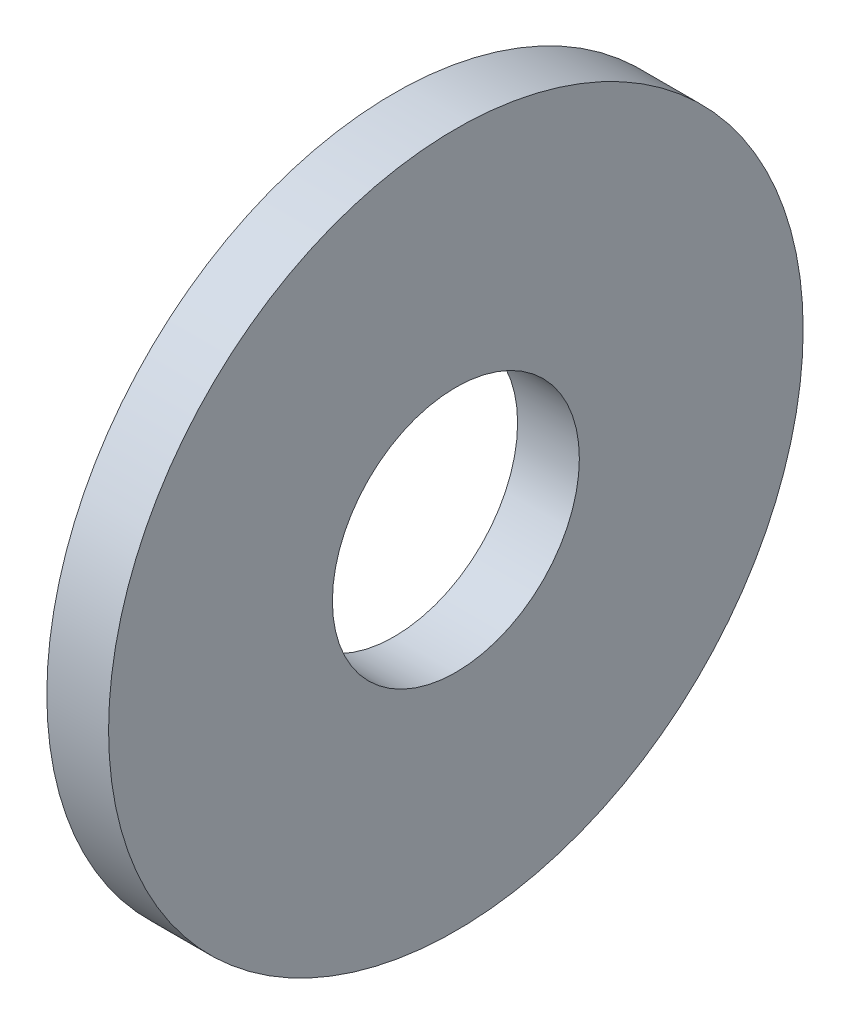
ISO-10303-21;
HEADER;
FILE_DESCRIPTION(('STEP AP214'),'2;1');
FILE_NAME('part.step','',(''),(''),'','','');
FILE_SCHEMA(('AUTOMOTIVE_DESIGN { 1 0 10303 214 1 1 1 1 }'));
ENDSEC;
DATA;
#1=APPLICATION_CONTEXT('core data for automotive mechanical design processes');
#2=APPLICATION_PROTOCOL_DEFINITION('international standard','automotive_design',2000,#1);
#3=PRODUCT_CONTEXT('',#1,'mechanical');
#4=PRODUCT('Part','Part','',(#3));
#5=PRODUCT_RELATED_PRODUCT_CATEGORY('part','',(#4));
#6=PRODUCT_DEFINITION_FORMATION('','',#4);
#7=PRODUCT_DEFINITION_CONTEXT('part definition',#1,'design');
#8=PRODUCT_DEFINITION('design','',#6,#7);
#9=PRODUCT_DEFINITION_SHAPE('','',#8);
#10=(LENGTH_UNIT() NAMED_UNIT(*) SI_UNIT(.MILLI.,.METRE.));
#11=(NAMED_UNIT(*) PLANE_ANGLE_UNIT() SI_UNIT($,.RADIAN.));
#12=(NAMED_UNIT(*) SI_UNIT($,.STERADIAN.) SOLID_ANGLE_UNIT());
#13=UNCERTAINTY_MEASURE_WITH_UNIT(LENGTH_MEASURE(1.E-05),#10,'distance_accuracy_value','');
#14=(GEOMETRIC_REPRESENTATION_CONTEXT(3) GLOBAL_UNCERTAINTY_ASSIGNED_CONTEXT((#13)) GLOBAL_UNIT_ASSIGNED_CONTEXT((#10,
#11,#12)) REPRESENTATION_CONTEXT('',''));
#15=CARTESIAN_POINT('',(0.,0.,0.));
#16=DIRECTION('',(0.,0.,1.));
#17=DIRECTION('',(1.,0.,0.));
#18=AXIS2_PLACEMENT_3D('',#15,#16,#17);
#19=CARTESIAN_POINT('',(-1.6,9.,0.));
#20=DIRECTION('',(1.,0.,0.));
#21=DIRECTION('',(0.,0.,-1.));
#22=AXIS2_PLACEMENT_3D('',#19,#20,#21);
#23=PLANE('',#22);
#24=CARTESIAN_POINT('',(-1.6,0.,0.));
#25=DIRECTION('',(-1.,0.,0.));
#26=DIRECTION('',(0.,0.,1.));
#27=AXIS2_PLACEMENT_3D('',#24,#25,#26);
#28=CIRCLE('',#27,9.);
#29=CARTESIAN_POINT('',(-1.6,0.,9.));
#30=VERTEX_POINT('',#29);
#31=EDGE_CURVE('E17',#30,#30,#28,.F.);
#32=ORIENTED_EDGE('',*,*,#31,.F.);
#33=EDGE_LOOP('',(#32));
#34=FACE_BOUND('',#33,.T.);
#35=CARTESIAN_POINT('',(-1.6,0.,0.));
#36=DIRECTION('',(-1.,0.,0.));
#37=DIRECTION('',(0.,0.,1.));
#38=AXIS2_PLACEMENT_3D('',#35,#36,#37);
#39=CIRCLE('',#38,3.2);
#40=CARTESIAN_POINT('',(-1.6,0.,3.2));
#41=VERTEX_POINT('',#40);
#42=EDGE_CURVE('E26',#41,#41,#39,.F.);
#43=ORIENTED_EDGE('',*,*,#42,.T.);
#44=EDGE_LOOP('',(#43));
#45=FACE_BOUND('',#44,.T.);
#46=ADVANCED_FACE('F14',(#34,#45),#23,.F.);
#47=CARTESIAN_POINT('',(-34.9249999999999,0.,0.));
#48=DIRECTION('',(-1.,0.,0.));
#49=DIRECTION('',(0.,0.,1.));
#50=AXIS2_PLACEMENT_3D('',#47,#48,#49);
#51=CYLINDRICAL_SURFACE('',#50,9.);
#52=ORIENTED_EDGE('',*,*,#31,.T.);
#53=EDGE_LOOP('',(#52));
#54=FACE_BOUND('',#53,.T.);
#55=CARTESIAN_POINT('',(0.,0.,0.));
#56=DIRECTION('',(-1.,0.,0.));
#57=DIRECTION('',(0.,0.,1.));
#58=AXIS2_PLACEMENT_3D('',#55,#56,#57);
#59=CIRCLE('',#58,9.);
#60=CARTESIAN_POINT('',(0.,0.,9.));
#61=VERTEX_POINT('',#60);
#62=EDGE_CURVE('E21',#61,#61,#59,.T.);
#63=ORIENTED_EDGE('',*,*,#62,.T.);
#64=EDGE_LOOP('',(#63));
#65=FACE_BOUND('',#64,.T.);
#66=ADVANCED_FACE('F34',(#54,#65),#51,.T.);
#67=CARTESIAN_POINT('',(-34.9249999999999,0.,0.));
#68=DIRECTION('',(-1.,0.,0.));
#69=DIRECTION('',(0.,0.,1.));
#70=AXIS2_PLACEMENT_3D('',#67,#68,#69);
#71=CYLINDRICAL_SURFACE('',#70,3.2);
#72=CARTESIAN_POINT('',(0.,0.,0.));
#73=DIRECTION('',(-1.,0.,0.));
#74=DIRECTION('',(0.,0.,1.));
#75=AXIS2_PLACEMENT_3D('',#72,#73,#74);
#76=CIRCLE('',#75,3.2);
#77=CARTESIAN_POINT('',(0.,0.,3.2));
#78=VERTEX_POINT('',#77);
#79=EDGE_CURVE('E10',#78,#78,#76,.F.);
#80=ORIENTED_EDGE('',*,*,#79,.T.);
#81=EDGE_LOOP('',(#80));
#82=FACE_BOUND('',#81,.T.);
#83=ORIENTED_EDGE('',*,*,#42,.F.);
#84=EDGE_LOOP('',(#83));
#85=FACE_BOUND('',#84,.T.);
#86=ADVANCED_FACE('F42',(#82,#85),#71,.F.);
#87=CARTESIAN_POINT('',(0.,3.2,0.));
#88=DIRECTION('',(-1.,0.,0.));
#89=DIRECTION('',(0.,0.,1.));
#90=AXIS2_PLACEMENT_3D('',#87,#88,#89);
#91=PLANE('',#90);
#92=ORIENTED_EDGE('',*,*,#79,.F.);
#93=EDGE_LOOP('',(#92));
#94=FACE_BOUND('',#93,.T.);
#95=ORIENTED_EDGE('',*,*,#62,.F.);
#96=EDGE_LOOP('',(#95));
#97=FACE_BOUND('',#96,.T.);
#98=ADVANCED_FACE('F43',(#94,#97),#91,.F.);
#99=CLOSED_SHELL('',(#46,#66,#86,#98));
#100=MANIFOLD_SOLID_BREP('B1',#99);
#101=ADVANCED_BREP_SHAPE_REPRESENTATION('',(#18,#100),#14);
#102=SHAPE_DEFINITION_REPRESENTATION(#9,#101);
ENDSEC;
END-ISO-10303-21;
